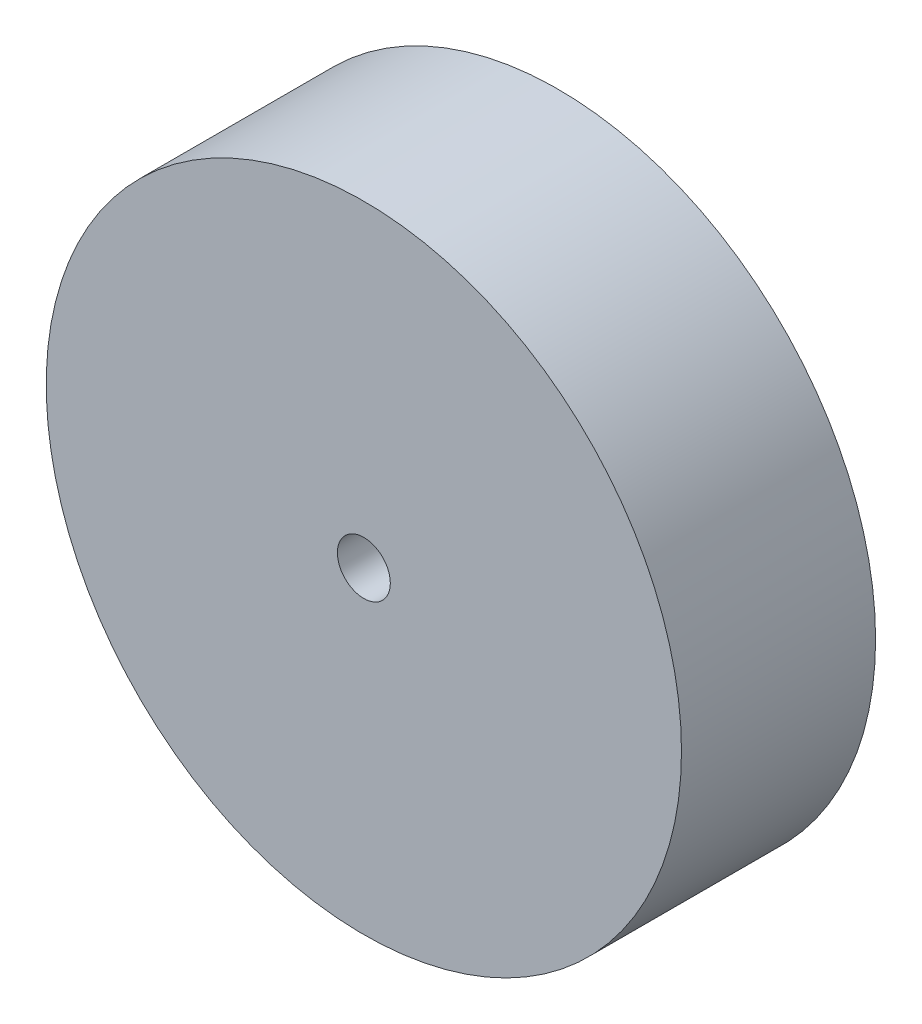
ISO-10303-21;
HEADER;
FILE_DESCRIPTION(('STEP AP214'),'2;1');
FILE_NAME('part.step','',(''),(''),'','','');
FILE_SCHEMA(('AUTOMOTIVE_DESIGN { 1 0 10303 214 1 1 1 1 }'));
ENDSEC;
DATA;
#1=APPLICATION_CONTEXT('core data for automotive mechanical design processes');
#2=APPLICATION_PROTOCOL_DEFINITION('international standard','automotive_design',2000,#1);
#3=PRODUCT_CONTEXT('',#1,'mechanical');
#4=PRODUCT('Part','Part','',(#3));
#5=PRODUCT_RELATED_PRODUCT_CATEGORY('part','',(#4));
#6=PRODUCT_DEFINITION_FORMATION('','',#4);
#7=PRODUCT_DEFINITION_CONTEXT('part definition',#1,'design');
#8=PRODUCT_DEFINITION('design','',#6,#7);
#9=PRODUCT_DEFINITION_SHAPE('','',#8);
#10=(LENGTH_UNIT() NAMED_UNIT(*) SI_UNIT(.MILLI.,.METRE.));
#11=(NAMED_UNIT(*) PLANE_ANGLE_UNIT() SI_UNIT($,.RADIAN.));
#12=(NAMED_UNIT(*) SI_UNIT($,.STERADIAN.) SOLID_ANGLE_UNIT());
#13=UNCERTAINTY_MEASURE_WITH_UNIT(LENGTH_MEASURE(1.E-05),#10,'distance_accuracy_value','');
#14=(GEOMETRIC_REPRESENTATION_CONTEXT(3) GLOBAL_UNCERTAINTY_ASSIGNED_CONTEXT((#13)) GLOBAL_UNIT_ASSIGNED_CONTEXT((#10,
#11,#12)) REPRESENTATION_CONTEXT('',''));
#15=CARTESIAN_POINT('',(0.,0.,0.));
#16=DIRECTION('',(0.,0.,1.));
#17=DIRECTION('',(1.,0.,0.));
#18=AXIS2_PLACEMENT_3D('',#15,#16,#17);
#19=CARTESIAN_POINT('',(0.,0.,3.));
#20=DIRECTION('',(0.,0.,-1.));
#21=DIRECTION('',(-1.,0.,0.));
#22=AXIS2_PLACEMENT_3D('',#19,#20,#21);
#23=CYLINDRICAL_SURFACE('',#22,2.75);
#24=CARTESIAN_POINT('',(0.,0.,3.));
#25=DIRECTION('',(0.,0.,1.));
#26=DIRECTION('',(1.,0.,0.));
#27=AXIS2_PLACEMENT_3D('',#24,#25,#26);
#28=CIRCLE('',#27,2.75);
#29=CARTESIAN_POINT('',(2.75,0.,3.));
#30=VERTEX_POINT('',#29);
#31=EDGE_CURVE('E46',#30,#30,#28,.T.);
#32=ORIENTED_EDGE('',*,*,#31,.F.);
#33=EDGE_LOOP('',(#32));
#34=FACE_BOUND('',#33,.T.);
#35=CARTESIAN_POINT('',(0.,0.,0.));
#36=DIRECTION('',(0.,0.,1.));
#37=DIRECTION('',(1.,0.,0.));
#38=AXIS2_PLACEMENT_3D('',#35,#36,#37);
#39=CIRCLE('',#38,2.75);
#40=CARTESIAN_POINT('',(2.75,0.,0.));
#41=VERTEX_POINT('',#40);
#42=EDGE_CURVE('E50',#41,#41,#39,.T.);
#43=ORIENTED_EDGE('',*,*,#42,.T.);
#44=EDGE_LOOP('',(#43));
#45=FACE_BOUND('',#44,.T.);
#46=ADVANCED_FACE('F35',(#34,#45),#23,.T.);
#47=CARTESIAN_POINT('',(0.,0.,0.));
#48=DIRECTION('',(0.,0.,1.));
#49=DIRECTION('',(1.,0.,0.));
#50=AXIS2_PLACEMENT_3D('',#47,#48,#49);
#51=PLANE('',#50);
#52=ORIENTED_EDGE('',*,*,#42,.F.);
#53=EDGE_LOOP('',(#52));
#54=FACE_BOUND('',#53,.T.);
#55=ADVANCED_FACE('F77',(#54),#51,.F.);
#56=CARTESIAN_POINT('',(0.,0.,8.5));
#57=DIRECTION('',(0.,0.,-1.));
#58=DIRECTION('',(-1.,0.,0.));
#59=AXIS2_PLACEMENT_3D('',#56,#57,#58);
#60=CYLINDRICAL_SURFACE('',#59,9.);
#61=CARTESIAN_POINT('',(0.,0.,8.5));
#62=DIRECTION('',(0.,0.,1.));
#63=DIRECTION('',(1.,0.,0.));
#64=AXIS2_PLACEMENT_3D('',#61,#62,#63);
#65=CIRCLE('',#64,9.);
#66=CARTESIAN_POINT('',(9.,0.,8.5));
#67=VERTEX_POINT('',#66);
#68=EDGE_CURVE('E54',#67,#67,#65,.T.);
#69=ORIENTED_EDGE('',*,*,#68,.F.);
#70=EDGE_LOOP('',(#69));
#71=FACE_BOUND('',#70,.T.);
#72=CARTESIAN_POINT('',(0.,0.,3.));
#73=DIRECTION('',(0.,0.,1.));
#74=DIRECTION('',(1.,0.,0.));
#75=AXIS2_PLACEMENT_3D('',#72,#73,#74);
#76=CIRCLE('',#75,9.);
#77=CARTESIAN_POINT('',(9.,0.,3.));
#78=VERTEX_POINT('',#77);
#79=EDGE_CURVE('E56',#78,#78,#76,.T.);
#80=ORIENTED_EDGE('',*,*,#79,.T.);
#81=EDGE_LOOP('',(#80));
#82=FACE_BOUND('',#81,.T.);
#83=ADVANCED_FACE('F71',(#71,#82),#60,.T.);
#84=CARTESIAN_POINT('',(0.,0.,8.5));
#85=DIRECTION('',(0.,0.,1.));
#86=DIRECTION('',(1.,0.,0.));
#87=AXIS2_PLACEMENT_3D('',#84,#85,#86);
#88=PLANE('',#87);
#89=CARTESIAN_POINT('',(0.,0.,8.5));
#90=DIRECTION('',(0.,0.,1.));
#91=DIRECTION('',(1.,0.,0.));
#92=AXIS2_PLACEMENT_3D('',#89,#90,#91);
#93=CIRCLE('',#92,0.75);
#94=CARTESIAN_POINT('',(0.75,0.,8.5));
#95=VERTEX_POINT('',#94);
#96=EDGE_CURVE('E59',#95,#95,#93,.T.);
#97=ORIENTED_EDGE('',*,*,#96,.F.);
#98=EDGE_LOOP('',(#97));
#99=FACE_BOUND('',#98,.T.);
#100=ORIENTED_EDGE('',*,*,#68,.T.);
#101=EDGE_LOOP('',(#100));
#102=FACE_BOUND('',#101,.T.);
#103=ADVANCED_FACE('F67',(#99,#102),#88,.T.);
#104=CARTESIAN_POINT('',(0.,0.,3.));
#105=DIRECTION('',(0.,0.,1.));
#106=DIRECTION('',(1.,0.,0.));
#107=AXIS2_PLACEMENT_3D('',#104,#105,#106);
#108=PLANE('',#107);
#109=ORIENTED_EDGE('',*,*,#31,.T.);
#110=EDGE_LOOP('',(#109));
#111=FACE_BOUND('',#110,.T.);
#112=ORIENTED_EDGE('',*,*,#79,.F.);
#113=EDGE_LOOP('',(#112));
#114=FACE_BOUND('',#113,.T.);
#115=ADVANCED_FACE('F70',(#111,#114),#108,.F.);
#116=CARTESIAN_POINT('',(0.,0.,1.));
#117=DIRECTION('',(0.,0.,1.));
#118=DIRECTION('',(1.,0.,0.));
#119=AXIS2_PLACEMENT_3D('',#116,#117,#118);
#120=CYLINDRICAL_SURFACE('',#119,0.75);
#121=CARTESIAN_POINT('',(0.,0.,1.7));
#122=DIRECTION('',(0.,0.,1.));
#123=DIRECTION('',(1.,0.,0.));
#124=AXIS2_PLACEMENT_3D('',#121,#122,#123);
#125=CIRCLE('',#124,0.75);
#126=CARTESIAN_POINT('',(0.75,0.,1.7));
#127=VERTEX_POINT('',#126);
#128=EDGE_CURVE('E10',#127,#127,#125,.F.);
#129=ORIENTED_EDGE('',*,*,#128,.T.);
#130=EDGE_LOOP('',(#129));
#131=FACE_BOUND('',#130,.T.);
#132=ORIENTED_EDGE('',*,*,#96,.T.);
#133=EDGE_LOOP('',(#132));
#134=FACE_BOUND('',#133,.T.);
#135=ADVANCED_FACE('F65',(#131,#134),#120,.F.);
#136=CARTESIAN_POINT('',(0.,0.,1.));
#137=DIRECTION('',(0.,0.,1.));
#138=DIRECTION('',(1.,0.,0.));
#139=AXIS2_PLACEMENT_3D('',#136,#137,#138);
#140=PLANE('',#139);
#141=CARTESIAN_POINT('',(0.,0.,1.));
#142=DIRECTION('',(0.,0.,1.));
#143=DIRECTION('',(1.,0.,0.));
#144=AXIS2_PLACEMENT_3D('',#141,#142,#143);
#145=CIRCLE('',#144,0.049999999999998);
#146=CARTESIAN_POINT('',(0.049999999999998,0.,1.));
#147=VERTEX_POINT('',#146);
#148=EDGE_CURVE('E42',#147,#147,#145,.T.);
#149=ORIENTED_EDGE('',*,*,#148,.T.);
#150=EDGE_LOOP('',(#149));
#151=FACE_BOUND('',#150,.T.);
#152=ADVANCED_FACE('F87',(#151),#140,.T.);
#153=CARTESIAN_POINT('',(0.,0.,1.));
#154=DIRECTION('',(0.,0.,1.));
#155=DIRECTION('',(1.,0.,0.));
#156=AXIS2_PLACEMENT_3D('',#153,#154,#155);
#157=CONICAL_SURFACE('',#156,0.049999999999998,0.785398163397451);
#158=ORIENTED_EDGE('',*,*,#128,.F.);
#159=EDGE_LOOP('',(#158));
#160=FACE_BOUND('',#159,.T.);
#161=ORIENTED_EDGE('',*,*,#148,.F.);
#162=EDGE_LOOP('',(#161));
#163=FACE_BOUND('',#162,.T.);
#164=ADVANCED_FACE('F37',(#160,#163),#157,.F.);
#165=CLOSED_SHELL('',(#46,#55,#83,#103,#115,#135,#152,#164));
#166=MANIFOLD_SOLID_BREP('B2',#165);
#167=ADVANCED_BREP_SHAPE_REPRESENTATION('',(#18,#166),#14);
#168=SHAPE_DEFINITION_REPRESENTATION(#9,#167);
ENDSEC;
END-ISO-10303-21;
